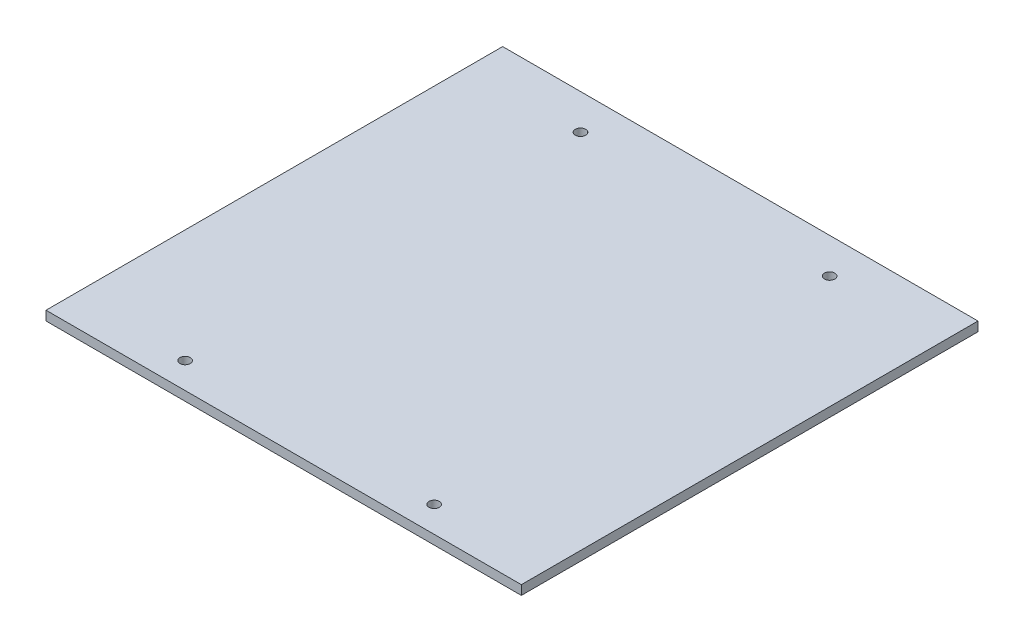
ISO-10303-21;
HEADER;
FILE_DESCRIPTION(('STEP AP214'),'2;1');
FILE_NAME('part.step','',(''),(''),'','','');
FILE_SCHEMA(('AUTOMOTIVE_DESIGN { 1 0 10303 214 1 1 1 1 }'));
ENDSEC;
DATA;
#1=APPLICATION_CONTEXT('core data for automotive mechanical design processes');
#2=APPLICATION_PROTOCOL_DEFINITION('international standard','automotive_design',2000,#1);
#3=PRODUCT_CONTEXT('',#1,'mechanical');
#4=PRODUCT('Part','Part','',(#3));
#5=PRODUCT_RELATED_PRODUCT_CATEGORY('part','',(#4));
#6=PRODUCT_DEFINITION_FORMATION('','',#4);
#7=PRODUCT_DEFINITION_CONTEXT('part definition',#1,'design');
#8=PRODUCT_DEFINITION('design','',#6,#7);
#9=PRODUCT_DEFINITION_SHAPE('','',#8);
#10=(LENGTH_UNIT() NAMED_UNIT(*) SI_UNIT(.MILLI.,.METRE.));
#11=(NAMED_UNIT(*) PLANE_ANGLE_UNIT() SI_UNIT($,.RADIAN.));
#12=(NAMED_UNIT(*) SI_UNIT($,.STERADIAN.) SOLID_ANGLE_UNIT());
#13=UNCERTAINTY_MEASURE_WITH_UNIT(LENGTH_MEASURE(1.E-05),#10,'distance_accuracy_value','');
#14=(GEOMETRIC_REPRESENTATION_CONTEXT(3) GLOBAL_UNCERTAINTY_ASSIGNED_CONTEXT((#13)) GLOBAL_UNIT_ASSIGNED_CONTEXT((#10,
#11,#12)) REPRESENTATION_CONTEXT('',''));
#15=CARTESIAN_POINT('',(0.,0.,0.));
#16=DIRECTION('',(0.,0.,1.));
#17=DIRECTION('',(1.,0.,0.));
#18=AXIS2_PLACEMENT_3D('',#15,#16,#17);
#19=CARTESIAN_POINT('',(114.5,4.5,110.));
#20=DIRECTION('',(-1.,0.,0.));
#21=DIRECTION('',(0.,0.,1.));
#22=AXIS2_PLACEMENT_3D('',#19,#20,#21);
#23=PLANE('',#22);
#24=DIRECTION('',(0.,0.,-1.));
#25=VECTOR('',#24,1.);
#26=CARTESIAN_POINT('',(114.5,0.,110.));
#27=LINE('',#26,#25);
#28=CARTESIAN_POINT('',(114.5,0.,110.));
#29=VERTEX_POINT('',#28);
#30=CARTESIAN_POINT('',(114.5,0.,-110.));
#31=VERTEX_POINT('',#30);
#32=EDGE_CURVE('E96',#29,#31,#27,.T.);
#33=ORIENTED_EDGE('',*,*,#32,.T.);
#34=DIRECTION('',(0.,-1.,0.));
#35=VECTOR('',#34,1.);
#36=CARTESIAN_POINT('',(114.5,4.5,-110.));
#37=LINE('',#36,#35);
#38=CARTESIAN_POINT('',(114.5,4.5,-110.));
#39=VERTEX_POINT('',#38);
#40=EDGE_CURVE('E11',#39,#31,#37,.T.);
#41=ORIENTED_EDGE('',*,*,#40,.F.);
#42=DIRECTION('',(0.,0.,-1.));
#43=VECTOR('',#42,1.);
#44=CARTESIAN_POINT('',(114.5,4.5,110.));
#45=LINE('',#44,#43);
#46=CARTESIAN_POINT('',(114.5,4.5,110.));
#47=VERTEX_POINT('',#46);
#48=EDGE_CURVE('E84',#47,#39,#45,.T.);
#49=ORIENTED_EDGE('',*,*,#48,.F.);
#50=DIRECTION('',(0.,-1.,0.));
#51=VECTOR('',#50,1.);
#52=CARTESIAN_POINT('',(114.5,4.5,110.));
#53=LINE('',#52,#51);
#54=EDGE_CURVE('E92',#47,#29,#53,.T.);
#55=ORIENTED_EDGE('',*,*,#54,.T.);
#56=EDGE_LOOP('',(#33,#41,#49,#55));
#57=FACE_BOUND('',#56,.T.);
#58=ADVANCED_FACE('F33',(#57),#23,.F.);
#59=CARTESIAN_POINT('',(-114.5,4.5,-110.));
#60=DIRECTION('',(0.,0.,1.));
#61=DIRECTION('',(1.,0.,0.));
#62=AXIS2_PLACEMENT_3D('',#59,#60,#61);
#63=PLANE('',#62);
#64=DIRECTION('',(-1.,0.,0.));
#65=VECTOR('',#64,1.);
#66=CARTESIAN_POINT('',(-114.5,0.,-110.));
#67=LINE('',#66,#65);
#68=CARTESIAN_POINT('',(-114.5,0.,-110.));
#69=VERTEX_POINT('',#68);
#70=EDGE_CURVE('E88',#31,#69,#67,.T.);
#71=ORIENTED_EDGE('',*,*,#70,.T.);
#72=DIRECTION('',(0.,-1.,0.));
#73=VECTOR('',#72,1.);
#74=CARTESIAN_POINT('',(-114.5,4.5,-110.));
#75=LINE('',#74,#73);
#76=CARTESIAN_POINT('',(-114.5,4.5,-110.));
#77=VERTEX_POINT('',#76);
#78=EDGE_CURVE('E41',#77,#69,#75,.T.);
#79=ORIENTED_EDGE('',*,*,#78,.F.);
#80=DIRECTION('',(-1.,0.,0.));
#81=VECTOR('',#80,1.);
#82=CARTESIAN_POINT('',(-114.5,4.5,-110.));
#83=LINE('',#82,#81);
#84=EDGE_CURVE('E79',#39,#77,#83,.T.);
#85=ORIENTED_EDGE('',*,*,#84,.F.);
#86=ORIENTED_EDGE('',*,*,#40,.T.);
#87=EDGE_LOOP('',(#71,#79,#85,#86));
#88=FACE_BOUND('',#87,.T.);
#89=ADVANCED_FACE('F87',(#88),#63,.F.);
#90=CARTESIAN_POINT('',(-114.5,4.5,110.));
#91=DIRECTION('',(1.,0.,0.));
#92=DIRECTION('',(0.,0.,-1.));
#93=AXIS2_PLACEMENT_3D('',#90,#91,#92);
#94=PLANE('',#93);
#95=DIRECTION('',(0.,0.,1.));
#96=VECTOR('',#95,1.);
#97=CARTESIAN_POINT('',(-114.5,0.,110.));
#98=LINE('',#97,#96);
#99=CARTESIAN_POINT('',(-114.5,0.,110.));
#100=VERTEX_POINT('',#99);
#101=EDGE_CURVE('E66',#69,#100,#98,.T.);
#102=ORIENTED_EDGE('',*,*,#101,.T.);
#103=DIRECTION('',(0.,-1.,0.));
#104=VECTOR('',#103,1.);
#105=CARTESIAN_POINT('',(-114.5,4.5,110.));
#106=LINE('',#105,#104);
#107=CARTESIAN_POINT('',(-114.5,4.5,110.));
#108=VERTEX_POINT('',#107);
#109=EDGE_CURVE('E89',#108,#100,#106,.T.);
#110=ORIENTED_EDGE('',*,*,#109,.F.);
#111=DIRECTION('',(0.,0.,1.));
#112=VECTOR('',#111,1.);
#113=CARTESIAN_POINT('',(-114.5,4.5,110.));
#114=LINE('',#113,#112);
#115=EDGE_CURVE('E82',#77,#108,#114,.T.);
#116=ORIENTED_EDGE('',*,*,#115,.F.);
#117=ORIENTED_EDGE('',*,*,#78,.T.);
#118=EDGE_LOOP('',(#102,#110,#116,#117));
#119=FACE_BOUND('',#118,.T.);
#120=ADVANCED_FACE('F90',(#119),#94,.F.);
#121=CARTESIAN_POINT('',(-114.5,4.5,110.));
#122=DIRECTION('',(0.,0.,-1.));
#123=DIRECTION('',(-1.,0.,0.));
#124=AXIS2_PLACEMENT_3D('',#121,#122,#123);
#125=PLANE('',#124);
#126=DIRECTION('',(1.,0.,0.));
#127=VECTOR('',#126,1.);
#128=CARTESIAN_POINT('',(-114.5,0.,110.));
#129=LINE('',#128,#127);
#130=EDGE_CURVE('E72',#100,#29,#129,.T.);
#131=ORIENTED_EDGE('',*,*,#130,.T.);
#132=ORIENTED_EDGE('',*,*,#54,.F.);
#133=DIRECTION('',(1.,0.,0.));
#134=VECTOR('',#133,1.);
#135=CARTESIAN_POINT('',(-114.5,4.5,110.));
#136=LINE('',#135,#134);
#137=EDGE_CURVE('E49',#108,#47,#136,.T.);
#138=ORIENTED_EDGE('',*,*,#137,.F.);
#139=ORIENTED_EDGE('',*,*,#109,.T.);
#140=EDGE_LOOP('',(#131,#132,#138,#139));
#141=FACE_BOUND('',#140,.T.);
#142=ADVANCED_FACE('F104',(#141),#125,.F.);
#143=CARTESIAN_POINT('',(0.,4.5,0.));
#144=DIRECTION('',(0.,-1.,0.));
#145=DIRECTION('',(0.,0.,-1.));
#146=AXIS2_PLACEMENT_3D('',#143,#144,#145);
#147=PLANE('',#146);
#148=CARTESIAN_POINT('',(60.0000000000001,4.5,97.5));
#149=DIRECTION('',(0.,-1.,0.));
#150=DIRECTION('',(0.,0.,-1.));
#151=AXIS2_PLACEMENT_3D('',#148,#149,#150);
#152=CIRCLE('',#151,2.49999999999999);
#153=CARTESIAN_POINT('',(60.0000000000001,4.5,95.));
#154=VERTEX_POINT('',#153);
#155=EDGE_CURVE('E115',#154,#154,#152,.F.);
#156=ORIENTED_EDGE('',*,*,#155,.F.);
#157=EDGE_LOOP('',(#156));
#158=FACE_BOUND('',#157,.T.);
#159=CARTESIAN_POINT('',(60.0000000000001,4.5,-93.));
#160=DIRECTION('',(0.,-1.,0.));
#161=DIRECTION('',(0.,0.,-1.));
#162=AXIS2_PLACEMENT_3D('',#159,#160,#161);
#163=CIRCLE('',#162,2.5);
#164=CARTESIAN_POINT('',(60.0000000000001,4.5,-95.5));
#165=VERTEX_POINT('',#164);
#166=EDGE_CURVE('E123',#165,#165,#163,.F.);
#167=ORIENTED_EDGE('',*,*,#166,.F.);
#168=EDGE_LOOP('',(#167));
#169=FACE_BOUND('',#168,.T.);
#170=CARTESIAN_POINT('',(-59.9999999999999,4.5,-93.));
#171=DIRECTION('',(0.,-1.,0.));
#172=DIRECTION('',(0.,0.,-1.));
#173=AXIS2_PLACEMENT_3D('',#170,#171,#172);
#174=CIRCLE('',#173,2.5);
#175=CARTESIAN_POINT('',(-59.9999999999999,4.5,-95.5));
#176=VERTEX_POINT('',#175);
#177=EDGE_CURVE('E116',#176,#176,#174,.F.);
#178=ORIENTED_EDGE('',*,*,#177,.F.);
#179=EDGE_LOOP('',(#178));
#180=FACE_BOUND('',#179,.T.);
#181=CARTESIAN_POINT('',(-59.9999999999999,4.5,97.4999999999999));
#182=DIRECTION('',(0.,-1.,0.));
#183=DIRECTION('',(0.,0.,-1.));
#184=AXIS2_PLACEMENT_3D('',#181,#182,#183);
#185=CIRCLE('',#184,2.5);
#186=CARTESIAN_POINT('',(-59.9999999999999,4.5,94.9999999999999));
#187=VERTEX_POINT('',#186);
#188=EDGE_CURVE('E99',#187,#187,#185,.F.);
#189=ORIENTED_EDGE('',*,*,#188,.F.);
#190=EDGE_LOOP('',(#189));
#191=FACE_BOUND('',#190,.T.);
#192=ORIENTED_EDGE('',*,*,#48,.T.);
#193=ORIENTED_EDGE('',*,*,#84,.T.);
#194=ORIENTED_EDGE('',*,*,#115,.T.);
#195=ORIENTED_EDGE('',*,*,#137,.T.);
#196=EDGE_LOOP('',(#192,#193,#194,#195));
#197=FACE_BOUND('',#196,.T.);
#198=ADVANCED_FACE('F80',(#158,#169,#180,#191,#197),#147,.F.);
#199=CARTESIAN_POINT('',(0.,0.,0.));
#200=DIRECTION('',(0.,-1.,0.));
#201=DIRECTION('',(0.,0.,-1.));
#202=AXIS2_PLACEMENT_3D('',#199,#200,#201);
#203=PLANE('',#202);
#204=CARTESIAN_POINT('',(60.0000000000001,0.,97.5));
#205=DIRECTION('',(0.,-1.,0.));
#206=DIRECTION('',(0.,0.,-1.));
#207=AXIS2_PLACEMENT_3D('',#204,#205,#206);
#208=CIRCLE('',#207,2.49999999999999);
#209=CARTESIAN_POINT('',(60.0000000000001,0.,95.));
#210=VERTEX_POINT('',#209);
#211=EDGE_CURVE('E126',#210,#210,#208,.T.);
#212=ORIENTED_EDGE('',*,*,#211,.F.);
#213=EDGE_LOOP('',(#212));
#214=FACE_BOUND('',#213,.T.);
#215=CARTESIAN_POINT('',(60.0000000000001,0.,-93.));
#216=DIRECTION('',(0.,-1.,0.));
#217=DIRECTION('',(0.,0.,-1.));
#218=AXIS2_PLACEMENT_3D('',#215,#216,#217);
#219=CIRCLE('',#218,2.5);
#220=CARTESIAN_POINT('',(60.0000000000001,0.,-95.5));
#221=VERTEX_POINT('',#220);
#222=EDGE_CURVE('E119',#221,#221,#219,.T.);
#223=ORIENTED_EDGE('',*,*,#222,.F.);
#224=EDGE_LOOP('',(#223));
#225=FACE_BOUND('',#224,.T.);
#226=CARTESIAN_POINT('',(-59.9999999999999,0.,-93.));
#227=DIRECTION('',(0.,-1.,0.));
#228=DIRECTION('',(0.,0.,-1.));
#229=AXIS2_PLACEMENT_3D('',#226,#227,#228);
#230=CIRCLE('',#229,2.5);
#231=CARTESIAN_POINT('',(-59.9999999999999,0.,-95.5));
#232=VERTEX_POINT('',#231);
#233=EDGE_CURVE('E120',#232,#232,#230,.T.);
#234=ORIENTED_EDGE('',*,*,#233,.F.);
#235=EDGE_LOOP('',(#234));
#236=FACE_BOUND('',#235,.T.);
#237=CARTESIAN_POINT('',(-59.9999999999999,0.,97.4999999999999));
#238=DIRECTION('',(0.,-1.,0.));
#239=DIRECTION('',(0.,0.,-1.));
#240=AXIS2_PLACEMENT_3D('',#237,#238,#239);
#241=CIRCLE('',#240,2.5);
#242=CARTESIAN_POINT('',(-59.9999999999999,0.,94.9999999999999));
#243=VERTEX_POINT('',#242);
#244=EDGE_CURVE('E112',#243,#243,#241,.T.);
#245=ORIENTED_EDGE('',*,*,#244,.F.);
#246=EDGE_LOOP('',(#245));
#247=FACE_BOUND('',#246,.T.);
#248=ORIENTED_EDGE('',*,*,#32,.F.);
#249=ORIENTED_EDGE('',*,*,#130,.F.);
#250=ORIENTED_EDGE('',*,*,#101,.F.);
#251=ORIENTED_EDGE('',*,*,#70,.F.);
#252=EDGE_LOOP('',(#248,#249,#250,#251));
#253=FACE_BOUND('',#252,.T.);
#254=ADVANCED_FACE('F107',(#214,#225,#236,#247,#253),#203,.T.);
#255=CARTESIAN_POINT('',(-59.9999999999999,4.501,97.4999999999999));
#256=DIRECTION('',(0.,-1.,0.));
#257=DIRECTION('',(0.,0.,-1.));
#258=AXIS2_PLACEMENT_3D('',#255,#256,#257);
#259=CYLINDRICAL_SURFACE('',#258,2.5);
#260=ORIENTED_EDGE('',*,*,#244,.T.);
#261=EDGE_LOOP('',(#260));
#262=FACE_BOUND('',#261,.T.);
#263=ORIENTED_EDGE('',*,*,#188,.T.);
#264=EDGE_LOOP('',(#263));
#265=FACE_BOUND('',#264,.T.);
#266=ADVANCED_FACE('F139',(#262,#265),#259,.F.);
#267=CARTESIAN_POINT('',(-59.9999999999999,4.501,-93.));
#268=DIRECTION('',(0.,-1.,0.));
#269=DIRECTION('',(0.,0.,-1.));
#270=AXIS2_PLACEMENT_3D('',#267,#268,#269);
#271=CYLINDRICAL_SURFACE('',#270,2.5);
#272=ORIENTED_EDGE('',*,*,#233,.T.);
#273=EDGE_LOOP('',(#272));
#274=FACE_BOUND('',#273,.T.);
#275=ORIENTED_EDGE('',*,*,#177,.T.);
#276=EDGE_LOOP('',(#275));
#277=FACE_BOUND('',#276,.T.);
#278=ADVANCED_FACE('F149',(#274,#277),#271,.F.);
#279=CARTESIAN_POINT('',(60.0000000000001,4.501,-93.));
#280=DIRECTION('',(0.,-1.,0.));
#281=DIRECTION('',(0.,0.,-1.));
#282=AXIS2_PLACEMENT_3D('',#279,#280,#281);
#283=CYLINDRICAL_SURFACE('',#282,2.5);
#284=ORIENTED_EDGE('',*,*,#222,.T.);
#285=EDGE_LOOP('',(#284));
#286=FACE_BOUND('',#285,.T.);
#287=ORIENTED_EDGE('',*,*,#166,.T.);
#288=EDGE_LOOP('',(#287));
#289=FACE_BOUND('',#288,.T.);
#290=ADVANCED_FACE('F201',(#286,#289),#283,.F.);
#291=CARTESIAN_POINT('',(60.0000000000001,4.501,97.5));
#292=DIRECTION('',(0.,-1.,0.));
#293=DIRECTION('',(0.,0.,-1.));
#294=AXIS2_PLACEMENT_3D('',#291,#292,#293);
#295=CYLINDRICAL_SURFACE('',#294,2.49999999999999);
#296=ORIENTED_EDGE('',*,*,#211,.T.);
#297=EDGE_LOOP('',(#296));
#298=FACE_BOUND('',#297,.T.);
#299=ORIENTED_EDGE('',*,*,#155,.T.);
#300=EDGE_LOOP('',(#299));
#301=FACE_BOUND('',#300,.T.);
#302=ADVANCED_FACE('F134',(#298,#301),#295,.F.);
#303=CLOSED_SHELL('',(#58,#89,#120,#142,#198,#254,#266,#278,#290,#302));
#304=MANIFOLD_SOLID_BREP('B2',#303);
#305=ADVANCED_BREP_SHAPE_REPRESENTATION('',(#18,#304),#14);
#306=SHAPE_DEFINITION_REPRESENTATION(#9,#305);
ENDSEC;
END-ISO-10303-21;
